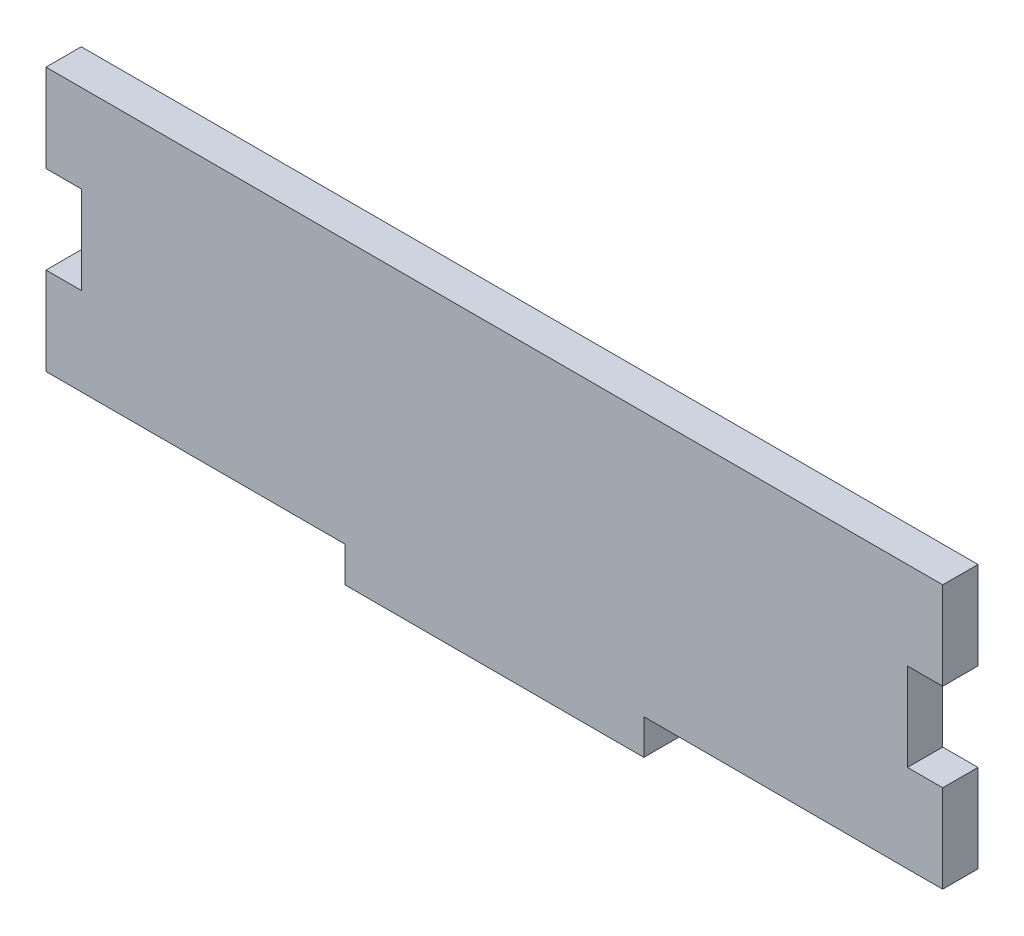
ISO-10303-21;
HEADER;
FILE_DESCRIPTION(('STEP AP214'),'2;1');
FILE_NAME('part.step','',(''),(''),'','','');
FILE_SCHEMA(('AUTOMOTIVE_DESIGN { 1 0 10303 214 1 1 1 1 }'));
ENDSEC;
DATA;
#1=APPLICATION_CONTEXT('core data for automotive mechanical design processes');
#2=APPLICATION_PROTOCOL_DEFINITION('international standard','automotive_design',2000,#1);
#3=PRODUCT_CONTEXT('',#1,'mechanical');
#4=PRODUCT('Part','Part','',(#3));
#5=PRODUCT_RELATED_PRODUCT_CATEGORY('part','',(#4));
#6=PRODUCT_DEFINITION_FORMATION('','',#4);
#7=PRODUCT_DEFINITION_CONTEXT('part definition',#1,'design');
#8=PRODUCT_DEFINITION('design','',#6,#7);
#9=PRODUCT_DEFINITION_SHAPE('','',#8);
#10=(LENGTH_UNIT() NAMED_UNIT(*) SI_UNIT(.MILLI.,.METRE.));
#11=(NAMED_UNIT(*) PLANE_ANGLE_UNIT() SI_UNIT($,.RADIAN.));
#12=(NAMED_UNIT(*) SI_UNIT($,.STERADIAN.) SOLID_ANGLE_UNIT());
#13=UNCERTAINTY_MEASURE_WITH_UNIT(LENGTH_MEASURE(1.E-05),#10,'distance_accuracy_value','');
#14=(GEOMETRIC_REPRESENTATION_CONTEXT(3) GLOBAL_UNCERTAINTY_ASSIGNED_CONTEXT((#13)) GLOBAL_UNIT_ASSIGNED_CONTEXT((#10,
#11,#12)) REPRESENTATION_CONTEXT('',''));
#15=CARTESIAN_POINT('',(0.,0.,0.));
#16=DIRECTION('',(0.,0.,1.));
#17=DIRECTION('',(1.,0.,0.));
#18=AXIS2_PLACEMENT_3D('',#15,#16,#17);
#19=CARTESIAN_POINT('',(-15.3557630292889,18.8528592771537,2.9972));
#20=DIRECTION('',(0.,1.,0.));
#21=DIRECTION('',(0.,0.,1.));
#22=AXIS2_PLACEMENT_3D('',#19,#20,#21);
#23=PLANE('',#22);
#24=DIRECTION('',(1.,0.,0.));
#25=VECTOR('',#24,1.);
#26=CARTESIAN_POINT('',(-15.3557630292889,18.8528592771537,0.));
#27=LINE('',#26,#25);
#28=CARTESIAN_POINT('',(-15.3557630292889,18.8528592771537,0.));
#29=VERTEX_POINT('',#28);
#30=CARTESIAN_POINT('',(-12.3585630292889,18.8528592771537,0.));
#31=VERTEX_POINT('',#30);
#32=EDGE_CURVE('E177',#29,#31,#27,.T.);
#33=ORIENTED_EDGE('',*,*,#32,.T.);
#34=DIRECTION('',(0.,0.,-1.));
#35=VECTOR('',#34,1.);
#36=CARTESIAN_POINT('',(-12.3585630292889,18.8528592771537,2.9972));
#37=LINE('',#36,#35);
#38=CARTESIAN_POINT('',(-12.3585630292889,18.8528592771537,2.9972));
#39=VERTEX_POINT('',#38);
#40=EDGE_CURVE('E11',#39,#31,#37,.T.);
#41=ORIENTED_EDGE('',*,*,#40,.F.);
#42=DIRECTION('',(1.,0.,0.));
#43=VECTOR('',#42,1.);
#44=CARTESIAN_POINT('',(-15.3557630292889,18.8528592771537,2.9972));
#45=LINE('',#44,#43);
#46=CARTESIAN_POINT('',(-15.3557630292889,18.8528592771537,2.9972));
#47=VERTEX_POINT('',#46);
#48=EDGE_CURVE('E207',#47,#39,#45,.T.);
#49=ORIENTED_EDGE('',*,*,#48,.F.);
#50=DIRECTION('',(0.,0.,-1.));
#51=VECTOR('',#50,1.);
#52=CARTESIAN_POINT('',(-15.3557630292889,18.8528592771537,2.9972));
#53=LINE('',#52,#51);
#54=EDGE_CURVE('E173',#47,#29,#53,.T.);
#55=ORIENTED_EDGE('',*,*,#54,.T.);
#56=EDGE_LOOP('',(#33,#41,#49,#55));
#57=FACE_BOUND('',#56,.T.);
#58=ADVANCED_FACE('F33',(#57),#23,.F.);
#59=CARTESIAN_POINT('',(-12.3585630292889,18.8528592771537,2.9972));
#60=DIRECTION('',(1.,0.,0.));
#61=DIRECTION('',(0.,0.,-1.));
#62=AXIS2_PLACEMENT_3D('',#59,#60,#61);
#63=PLANE('',#62);
#64=DIRECTION('',(0.,-1.,0.));
#65=VECTOR('',#64,1.);
#66=CARTESIAN_POINT('',(-12.3585630292889,18.8528592771537,0.));
#67=LINE('',#66,#65);
#68=CARTESIAN_POINT('',(-12.3585630292889,11.3852592771537,0.));
#69=VERTEX_POINT('',#68);
#70=EDGE_CURVE('E180',#31,#69,#67,.T.);
#71=ORIENTED_EDGE('',*,*,#70,.T.);
#72=DIRECTION('',(0.,0.,-1.));
#73=VECTOR('',#72,1.);
#74=CARTESIAN_POINT('',(-12.3585630292889,11.3852592771537,2.9972));
#75=LINE('',#74,#73);
#76=CARTESIAN_POINT('',(-12.3585630292889,11.3852592771537,2.9972));
#77=VERTEX_POINT('',#76);
#78=EDGE_CURVE('E41',#77,#69,#75,.T.);
#79=ORIENTED_EDGE('',*,*,#78,.F.);
#80=DIRECTION('',(0.,-1.,0.));
#81=VECTOR('',#80,1.);
#82=CARTESIAN_POINT('',(-12.3585630292889,18.8528592771537,2.9972));
#83=LINE('',#82,#81);
#84=EDGE_CURVE('E116',#39,#77,#83,.T.);
#85=ORIENTED_EDGE('',*,*,#84,.F.);
#86=ORIENTED_EDGE('',*,*,#40,.T.);
#87=EDGE_LOOP('',(#71,#79,#85,#86));
#88=FACE_BOUND('',#87,.T.);
#89=ADVANCED_FACE('F305',(#88),#63,.F.);
#90=CARTESIAN_POINT('',(-15.3557630292889,11.3852592771537,2.9972));
#91=DIRECTION('',(0.,-1.,0.));
#92=DIRECTION('',(0.,0.,-1.));
#93=AXIS2_PLACEMENT_3D('',#90,#91,#92);
#94=PLANE('',#93);
#95=DIRECTION('',(-1.,0.,0.));
#96=VECTOR('',#95,1.);
#97=CARTESIAN_POINT('',(-15.3557630292889,11.3852592771537,0.));
#98=LINE('',#97,#96);
#99=CARTESIAN_POINT('',(-15.3557630292889,11.3852592771537,0.));
#100=VERTEX_POINT('',#99);
#101=EDGE_CURVE('E182',#69,#100,#98,.T.);
#102=ORIENTED_EDGE('',*,*,#101,.T.);
#103=DIRECTION('',(0.,0.,-1.));
#104=VECTOR('',#103,1.);
#105=CARTESIAN_POINT('',(-15.3557630292889,11.3852592771537,2.9972));
#106=LINE('',#105,#104);
#107=CARTESIAN_POINT('',(-15.3557630292889,11.3852592771537,2.9972));
#108=VERTEX_POINT('',#107);
#109=EDGE_CURVE('E238',#108,#100,#106,.T.);
#110=ORIENTED_EDGE('',*,*,#109,.F.);
#111=DIRECTION('',(-1.,0.,0.));
#112=VECTOR('',#111,1.);
#113=CARTESIAN_POINT('',(-15.3557630292889,11.3852592771537,2.9972));
#114=LINE('',#113,#112);
#115=EDGE_CURVE('E246',#77,#108,#114,.T.);
#116=ORIENTED_EDGE('',*,*,#115,.F.);
#117=ORIENTED_EDGE('',*,*,#78,.T.);
#118=EDGE_LOOP('',(#102,#110,#116,#117));
#119=FACE_BOUND('',#118,.T.);
#120=ADVANCED_FACE('F244',(#119),#94,.F.);
#121=CARTESIAN_POINT('',(-15.3557630292889,3.91765927715367,2.9972));
#122=DIRECTION('',(1.,0.,0.));
#123=DIRECTION('',(0.,1.,0.));
#124=AXIS2_PLACEMENT_3D('',#121,#122,#123);
#125=PLANE('',#124);
#126=DIRECTION('',(0.,-1.,0.));
#127=VECTOR('',#126,1.);
#128=CARTESIAN_POINT('',(-15.3557630292889,3.91765927715367,0.));
#129=LINE('',#128,#127);
#130=CARTESIAN_POINT('',(-15.3557630292889,3.91765927715367,0.));
#131=VERTEX_POINT('',#130);
#132=EDGE_CURVE('E184',#100,#131,#129,.T.);
#133=ORIENTED_EDGE('',*,*,#132,.T.);
#134=DIRECTION('',(0.,0.,-1.));
#135=VECTOR('',#134,1.);
#136=CARTESIAN_POINT('',(-15.3557630292889,3.91765927715367,2.9972));
#137=LINE('',#136,#135);
#138=CARTESIAN_POINT('',(-15.3557630292889,3.91765927715367,2.9972));
#139=VERTEX_POINT('',#138);
#140=EDGE_CURVE('E235',#139,#131,#137,.T.);
#141=ORIENTED_EDGE('',*,*,#140,.F.);
#142=DIRECTION('',(0.,-1.,0.));
#143=VECTOR('',#142,1.);
#144=CARTESIAN_POINT('',(-15.3557630292889,3.91765927715367,2.9972));
#145=LINE('',#144,#143);
#146=EDGE_CURVE('E264',#108,#139,#145,.T.);
#147=ORIENTED_EDGE('',*,*,#146,.F.);
#148=ORIENTED_EDGE('',*,*,#109,.T.);
#149=EDGE_LOOP('',(#133,#141,#147,#148));
#150=FACE_BOUND('',#149,.T.);
#151=ADVANCED_FACE('F255',(#150),#125,.F.);
#152=CARTESIAN_POINT('',(-15.3557630292889,3.91765927715367,2.9972));
#153=DIRECTION('',(0.,1.,0.));
#154=DIRECTION('',(0.,0.,1.));
#155=AXIS2_PLACEMENT_3D('',#152,#153,#154);
#156=PLANE('',#155);
#157=DIRECTION('',(1.,0.,0.));
#158=VECTOR('',#157,1.);
#159=CARTESIAN_POINT('',(-15.3557630292889,3.91765927715367,0.));
#160=LINE('',#159,#158);
#161=CARTESIAN_POINT('',(10.0442369707111,3.91765927715367,0.));
#162=VERTEX_POINT('',#161);
#163=EDGE_CURVE('E186',#131,#162,#160,.T.);
#164=ORIENTED_EDGE('',*,*,#163,.T.);
#165=DIRECTION('',(0.,0.,-1.));
#166=VECTOR('',#165,1.);
#167=CARTESIAN_POINT('',(10.0442369707111,3.91765927715367,2.9972));
#168=LINE('',#167,#166);
#169=CARTESIAN_POINT('',(10.0442369707111,3.91765927715367,2.9972));
#170=VERTEX_POINT('',#169);
#171=EDGE_CURVE('E232',#170,#162,#168,.T.);
#172=ORIENTED_EDGE('',*,*,#171,.F.);
#173=DIRECTION('',(1.,0.,0.));
#174=VECTOR('',#173,1.);
#175=CARTESIAN_POINT('',(-15.3557630292889,3.91765927715367,2.9972));
#176=LINE('',#175,#174);
#177=EDGE_CURVE('E261',#139,#170,#176,.T.);
#178=ORIENTED_EDGE('',*,*,#177,.F.);
#179=ORIENTED_EDGE('',*,*,#140,.T.);
#180=EDGE_LOOP('',(#164,#172,#178,#179));
#181=FACE_BOUND('',#180,.T.);
#182=ADVANCED_FACE('F259',(#181),#156,.F.);
#183=CARTESIAN_POINT('',(10.0442369707111,0.920459277153668,2.9972));
#184=DIRECTION('',(1.,0.,0.));
#185=DIRECTION('',(0.,1.,0.));
#186=AXIS2_PLACEMENT_3D('',#183,#184,#185);
#187=PLANE('',#186);
#188=DIRECTION('',(0.,-1.,0.));
#189=VECTOR('',#188,1.);
#190=CARTESIAN_POINT('',(10.0442369707111,0.920459277153668,0.));
#191=LINE('',#190,#189);
#192=CARTESIAN_POINT('',(10.0442369707111,0.920459277153668,0.));
#193=VERTEX_POINT('',#192);
#194=EDGE_CURVE('E188',#162,#193,#191,.T.);
#195=ORIENTED_EDGE('',*,*,#194,.T.);
#196=DIRECTION('',(0.,0.,-1.));
#197=VECTOR('',#196,1.);
#198=CARTESIAN_POINT('',(10.0442369707111,0.920459277153668,2.9972));
#199=LINE('',#198,#197);
#200=CARTESIAN_POINT('',(10.0442369707111,0.920459277153668,2.9972));
#201=VERTEX_POINT('',#200);
#202=EDGE_CURVE('E229',#201,#193,#199,.T.);
#203=ORIENTED_EDGE('',*,*,#202,.F.);
#204=DIRECTION('',(0.,-1.,0.));
#205=VECTOR('',#204,1.);
#206=CARTESIAN_POINT('',(10.0442369707111,0.920459277153668,2.9972));
#207=LINE('',#206,#205);
#208=EDGE_CURVE('E263',#170,#201,#207,.T.);
#209=ORIENTED_EDGE('',*,*,#208,.F.);
#210=ORIENTED_EDGE('',*,*,#171,.T.);
#211=EDGE_LOOP('',(#195,#203,#209,#210));
#212=FACE_BOUND('',#211,.T.);
#213=ADVANCED_FACE('F318',(#212),#187,.F.);
#214=CARTESIAN_POINT('',(10.0442369707111,0.920459277153668,2.9972));
#215=DIRECTION('',(0.,1.,0.));
#216=DIRECTION('',(0.,0.,1.));
#217=AXIS2_PLACEMENT_3D('',#214,#215,#216);
#218=PLANE('',#217);
#219=DIRECTION('',(1.,0.,0.));
#220=VECTOR('',#219,1.);
#221=CARTESIAN_POINT('',(10.0442369707111,0.920459277153668,0.));
#222=LINE('',#221,#220);
#223=CARTESIAN_POINT('',(35.4442369707111,0.920459277153668,0.));
#224=VERTEX_POINT('',#223);
#225=EDGE_CURVE('E190',#193,#224,#222,.T.);
#226=ORIENTED_EDGE('',*,*,#225,.T.);
#227=DIRECTION('',(0.,0.,-1.));
#228=VECTOR('',#227,1.);
#229=CARTESIAN_POINT('',(35.4442369707111,0.920459277153668,2.9972));
#230=LINE('',#229,#228);
#231=CARTESIAN_POINT('',(35.4442369707111,0.920459277153668,2.9972));
#232=VERTEX_POINT('',#231);
#233=EDGE_CURVE('E226',#232,#224,#230,.T.);
#234=ORIENTED_EDGE('',*,*,#233,.F.);
#235=DIRECTION('',(1.,0.,0.));
#236=VECTOR('',#235,1.);
#237=CARTESIAN_POINT('',(10.0442369707111,0.920459277153668,2.9972));
#238=LINE('',#237,#236);
#239=EDGE_CURVE('E266',#201,#232,#238,.T.);
#240=ORIENTED_EDGE('',*,*,#239,.F.);
#241=ORIENTED_EDGE('',*,*,#202,.T.);
#242=EDGE_LOOP('',(#226,#234,#240,#241));
#243=FACE_BOUND('',#242,.T.);
#244=ADVANCED_FACE('F321',(#243),#218,.F.);
#245=CARTESIAN_POINT('',(35.4442369707111,0.920459277153668,2.9972));
#246=DIRECTION('',(-1.,0.,0.));
#247=DIRECTION('',(0.,0.,1.));
#248=AXIS2_PLACEMENT_3D('',#245,#246,#247);
#249=PLANE('',#248);
#250=DIRECTION('',(0.,1.,0.));
#251=VECTOR('',#250,1.);
#252=CARTESIAN_POINT('',(35.4442369707111,0.920459277153668,0.));
#253=LINE('',#252,#251);
#254=CARTESIAN_POINT('',(35.4442369707111,3.91765927715367,0.));
#255=VERTEX_POINT('',#254);
#256=EDGE_CURVE('E192',#224,#255,#253,.T.);
#257=ORIENTED_EDGE('',*,*,#256,.T.);
#258=DIRECTION('',(0.,0.,-1.));
#259=VECTOR('',#258,1.);
#260=CARTESIAN_POINT('',(35.4442369707111,3.91765927715367,2.9972));
#261=LINE('',#260,#259);
#262=CARTESIAN_POINT('',(35.4442369707111,3.91765927715367,2.9972));
#263=VERTEX_POINT('',#262);
#264=EDGE_CURVE('E223',#263,#255,#261,.T.);
#265=ORIENTED_EDGE('',*,*,#264,.F.);
#266=DIRECTION('',(0.,1.,0.));
#267=VECTOR('',#266,1.);
#268=CARTESIAN_POINT('',(35.4442369707111,0.920459277153668,2.9972));
#269=LINE('',#268,#267);
#270=EDGE_CURVE('E272',#232,#263,#269,.T.);
#271=ORIENTED_EDGE('',*,*,#270,.F.);
#272=ORIENTED_EDGE('',*,*,#233,.T.);
#273=EDGE_LOOP('',(#257,#265,#271,#272));
#274=FACE_BOUND('',#273,.T.);
#275=ADVANCED_FACE('F325',(#274),#249,.F.);
#276=CARTESIAN_POINT('',(60.8442369707111,3.91765927715367,2.9972));
#277=DIRECTION('',(0.,1.,0.));
#278=DIRECTION('',(0.,0.,1.));
#279=AXIS2_PLACEMENT_3D('',#276,#277,#278);
#280=PLANE('',#279);
#281=DIRECTION('',(1.,0.,0.));
#282=VECTOR('',#281,1.);
#283=CARTESIAN_POINT('',(60.8442369707111,3.91765927715367,0.));
#284=LINE('',#283,#282);
#285=CARTESIAN_POINT('',(60.8442369707111,3.91765927715367,0.));
#286=VERTEX_POINT('',#285);
#287=EDGE_CURVE('E194',#255,#286,#284,.T.);
#288=ORIENTED_EDGE('',*,*,#287,.T.);
#289=DIRECTION('',(0.,0.,-1.));
#290=VECTOR('',#289,1.);
#291=CARTESIAN_POINT('',(60.8442369707111,3.91765927715367,2.9972));
#292=LINE('',#291,#290);
#293=CARTESIAN_POINT('',(60.8442369707111,3.91765927715367,2.9972));
#294=VERTEX_POINT('',#293);
#295=EDGE_CURVE('E220',#294,#286,#292,.T.);
#296=ORIENTED_EDGE('',*,*,#295,.F.);
#297=DIRECTION('',(1.,0.,0.));
#298=VECTOR('',#297,1.);
#299=CARTESIAN_POINT('',(60.8442369707111,3.91765927715367,2.9972));
#300=LINE('',#299,#298);
#301=EDGE_CURVE('E274',#263,#294,#300,.T.);
#302=ORIENTED_EDGE('',*,*,#301,.F.);
#303=ORIENTED_EDGE('',*,*,#264,.T.);
#304=EDGE_LOOP('',(#288,#296,#302,#303));
#305=FACE_BOUND('',#304,.T.);
#306=ADVANCED_FACE('F329',(#305),#280,.F.);
#307=CARTESIAN_POINT('',(60.8442369707111,3.91765927715367,2.9972));
#308=DIRECTION('',(-1.,0.,0.));
#309=DIRECTION('',(0.,-1.,0.));
#310=AXIS2_PLACEMENT_3D('',#307,#308,#309);
#311=PLANE('',#310);
#312=DIRECTION('',(0.,1.,0.));
#313=VECTOR('',#312,1.);
#314=CARTESIAN_POINT('',(60.8442369707111,3.91765927715367,0.));
#315=LINE('',#314,#313);
#316=CARTESIAN_POINT('',(60.8442369707111,11.3852592771537,0.));
#317=VERTEX_POINT('',#316);
#318=EDGE_CURVE('E196',#286,#317,#315,.T.);
#319=ORIENTED_EDGE('',*,*,#318,.T.);
#320=DIRECTION('',(0.,0.,-1.));
#321=VECTOR('',#320,1.);
#322=CARTESIAN_POINT('',(60.8442369707111,11.3852592771537,2.9972));
#323=LINE('',#322,#321);
#324=CARTESIAN_POINT('',(60.8442369707111,11.3852592771537,2.9972));
#325=VERTEX_POINT('',#324);
#326=EDGE_CURVE('E217',#325,#317,#323,.T.);
#327=ORIENTED_EDGE('',*,*,#326,.F.);
#328=DIRECTION('',(0.,1.,0.));
#329=VECTOR('',#328,1.);
#330=CARTESIAN_POINT('',(60.8442369707111,3.91765927715367,2.9972));
#331=LINE('',#330,#329);
#332=EDGE_CURVE('E276',#294,#325,#331,.T.);
#333=ORIENTED_EDGE('',*,*,#332,.F.);
#334=ORIENTED_EDGE('',*,*,#295,.T.);
#335=EDGE_LOOP('',(#319,#327,#333,#334));
#336=FACE_BOUND('',#335,.T.);
#337=ADVANCED_FACE('F333',(#336),#311,.F.);
#338=CARTESIAN_POINT('',(60.8442369707111,11.3852592771537,2.9972));
#339=DIRECTION('',(0.,-1.,0.));
#340=DIRECTION('',(0.,0.,-1.));
#341=AXIS2_PLACEMENT_3D('',#338,#339,#340);
#342=PLANE('',#341);
#343=DIRECTION('',(-1.,0.,0.));
#344=VECTOR('',#343,1.);
#345=CARTESIAN_POINT('',(60.8442369707111,11.3852592771537,0.));
#346=LINE('',#345,#344);
#347=CARTESIAN_POINT('',(57.8470369707111,11.3852592771537,0.));
#348=VERTEX_POINT('',#347);
#349=EDGE_CURVE('E198',#317,#348,#346,.T.);
#350=ORIENTED_EDGE('',*,*,#349,.T.);
#351=DIRECTION('',(0.,0.,-1.));
#352=VECTOR('',#351,1.);
#353=CARTESIAN_POINT('',(57.8470369707111,11.3852592771537,2.9972));
#354=LINE('',#353,#352);
#355=CARTESIAN_POINT('',(57.8470369707111,11.3852592771537,2.9972));
#356=VERTEX_POINT('',#355);
#357=EDGE_CURVE('E214',#356,#348,#354,.T.);
#358=ORIENTED_EDGE('',*,*,#357,.F.);
#359=DIRECTION('',(-1.,0.,0.));
#360=VECTOR('',#359,1.);
#361=CARTESIAN_POINT('',(60.8442369707111,11.3852592771537,2.9972));
#362=LINE('',#361,#360);
#363=EDGE_CURVE('E278',#325,#356,#362,.T.);
#364=ORIENTED_EDGE('',*,*,#363,.F.);
#365=ORIENTED_EDGE('',*,*,#326,.T.);
#366=EDGE_LOOP('',(#350,#358,#364,#365));
#367=FACE_BOUND('',#366,.T.);
#368=ADVANCED_FACE('F337',(#367),#342,.F.);
#369=CARTESIAN_POINT('',(57.8470369707111,18.8528592771537,2.9972));
#370=DIRECTION('',(-1.,0.,0.));
#371=DIRECTION('',(0.,0.,1.));
#372=AXIS2_PLACEMENT_3D('',#369,#370,#371);
#373=PLANE('',#372);
#374=DIRECTION('',(0.,1.,0.));
#375=VECTOR('',#374,1.);
#376=CARTESIAN_POINT('',(57.8470369707111,18.8528592771537,0.));
#377=LINE('',#376,#375);
#378=CARTESIAN_POINT('',(57.8470369707111,18.8528592771537,0.));
#379=VERTEX_POINT('',#378);
#380=EDGE_CURVE('E200',#348,#379,#377,.T.);
#381=ORIENTED_EDGE('',*,*,#380,.T.);
#382=DIRECTION('',(0.,0.,-1.));
#383=VECTOR('',#382,1.);
#384=CARTESIAN_POINT('',(57.8470369707111,18.8528592771537,2.9972));
#385=LINE('',#384,#383);
#386=CARTESIAN_POINT('',(57.8470369707111,18.8528592771537,2.9972));
#387=VERTEX_POINT('',#386);
#388=EDGE_CURVE('E211',#387,#379,#385,.T.);
#389=ORIENTED_EDGE('',*,*,#388,.F.);
#390=DIRECTION('',(0.,1.,0.));
#391=VECTOR('',#390,1.);
#392=CARTESIAN_POINT('',(57.8470369707111,18.8528592771537,2.9972));
#393=LINE('',#392,#391);
#394=EDGE_CURVE('E280',#356,#387,#393,.T.);
#395=ORIENTED_EDGE('',*,*,#394,.F.);
#396=ORIENTED_EDGE('',*,*,#357,.T.);
#397=EDGE_LOOP('',(#381,#389,#395,#396));
#398=FACE_BOUND('',#397,.T.);
#399=ADVANCED_FACE('F286',(#398),#373,.F.);
#400=CARTESIAN_POINT('',(60.8442369707111,18.8528592771537,2.9972));
#401=DIRECTION('',(0.,1.,0.));
#402=DIRECTION('',(0.,0.,1.));
#403=AXIS2_PLACEMENT_3D('',#400,#401,#402);
#404=PLANE('',#403);
#405=DIRECTION('',(1.,0.,0.));
#406=VECTOR('',#405,1.);
#407=CARTESIAN_POINT('',(60.8442369707111,18.8528592771537,0.));
#408=LINE('',#407,#406);
#409=CARTESIAN_POINT('',(60.8442369707111,18.8528592771537,0.));
#410=VERTEX_POINT('',#409);
#411=EDGE_CURVE('E202',#379,#410,#408,.T.);
#412=ORIENTED_EDGE('',*,*,#411,.T.);
#413=DIRECTION('',(0.,0.,-1.));
#414=VECTOR('',#413,1.);
#415=CARTESIAN_POINT('',(60.8442369707111,18.8528592771537,2.9972));
#416=LINE('',#415,#414);
#417=CARTESIAN_POINT('',(60.8442369707111,18.8528592771537,2.9972));
#418=VERTEX_POINT('',#417);
#419=EDGE_CURVE('E168',#418,#410,#416,.T.);
#420=ORIENTED_EDGE('',*,*,#419,.F.);
#421=DIRECTION('',(1.,0.,0.));
#422=VECTOR('',#421,1.);
#423=CARTESIAN_POINT('',(60.8442369707111,18.8528592771537,2.9972));
#424=LINE('',#423,#422);
#425=EDGE_CURVE('E159',#387,#418,#424,.T.);
#426=ORIENTED_EDGE('',*,*,#425,.F.);
#427=ORIENTED_EDGE('',*,*,#388,.T.);
#428=EDGE_LOOP('',(#412,#420,#426,#427));
#429=FACE_BOUND('',#428,.T.);
#430=ADVANCED_FACE('F290',(#429),#404,.F.);
#431=CARTESIAN_POINT('',(60.8442369707111,18.8528592771537,2.9972));
#432=DIRECTION('',(-1.,0.,0.));
#433=DIRECTION('',(0.,0.,1.));
#434=AXIS2_PLACEMENT_3D('',#431,#432,#433);
#435=PLANE('',#434);
#436=DIRECTION('',(0.,1.,0.));
#437=VECTOR('',#436,1.);
#438=CARTESIAN_POINT('',(60.8442369707111,18.8528592771537,0.));
#439=LINE('',#438,#437);
#440=CARTESIAN_POINT('',(60.8442369707111,26.3204592771537,0.));
#441=VERTEX_POINT('',#440);
#442=EDGE_CURVE('E167',#410,#441,#439,.T.);
#443=ORIENTED_EDGE('',*,*,#442,.T.);
#444=DIRECTION('',(0.,0.,-1.));
#445=VECTOR('',#444,1.);
#446=CARTESIAN_POINT('',(60.8442369707111,26.3204592771537,2.9972));
#447=LINE('',#446,#445);
#448=CARTESIAN_POINT('',(60.8442369707111,26.3204592771537,2.9972));
#449=VERTEX_POINT('',#448);
#450=EDGE_CURVE('E164',#449,#441,#447,.T.);
#451=ORIENTED_EDGE('',*,*,#450,.F.);
#452=DIRECTION('',(0.,1.,0.));
#453=VECTOR('',#452,1.);
#454=CARTESIAN_POINT('',(60.8442369707111,18.8528592771537,2.9972));
#455=LINE('',#454,#453);
#456=EDGE_CURVE('E153',#418,#449,#455,.T.);
#457=ORIENTED_EDGE('',*,*,#456,.F.);
#458=ORIENTED_EDGE('',*,*,#419,.T.);
#459=EDGE_LOOP('',(#443,#451,#457,#458));
#460=FACE_BOUND('',#459,.T.);
#461=ADVANCED_FACE('F165',(#460),#435,.F.);
#462=CARTESIAN_POINT('',(-15.3557630292889,26.3204592771537,2.9972));
#463=DIRECTION('',(0.,-1.,0.));
#464=DIRECTION('',(0.,0.,-1.));
#465=AXIS2_PLACEMENT_3D('',#462,#463,#464);
#466=PLANE('',#465);
#467=DIRECTION('',(-1.,0.,0.));
#468=VECTOR('',#467,1.);
#469=CARTESIAN_POINT('',(-15.3557630292889,26.3204592771537,0.));
#470=LINE('',#469,#468);
#471=CARTESIAN_POINT('',(-15.3557630292889,26.3204592771537,0.));
#472=VERTEX_POINT('',#471);
#473=EDGE_CURVE('E102',#441,#472,#470,.T.);
#474=ORIENTED_EDGE('',*,*,#473,.T.);
#475=DIRECTION('',(0.,0.,-1.));
#476=VECTOR('',#475,1.);
#477=CARTESIAN_POINT('',(-15.3557630292889,26.3204592771537,2.9972));
#478=LINE('',#477,#476);
#479=CARTESIAN_POINT('',(-15.3557630292889,26.3204592771537,2.9972));
#480=VERTEX_POINT('',#479);
#481=EDGE_CURVE('E169',#480,#472,#478,.T.);
#482=ORIENTED_EDGE('',*,*,#481,.F.);
#483=DIRECTION('',(-1.,0.,0.));
#484=VECTOR('',#483,1.);
#485=CARTESIAN_POINT('',(-15.3557630292889,26.3204592771537,2.9972));
#486=LINE('',#485,#484);
#487=EDGE_CURVE('E157',#449,#480,#486,.T.);
#488=ORIENTED_EDGE('',*,*,#487,.F.);
#489=ORIENTED_EDGE('',*,*,#450,.T.);
#490=EDGE_LOOP('',(#474,#482,#488,#489));
#491=FACE_BOUND('',#490,.T.);
#492=ADVANCED_FACE('F171',(#491),#466,.F.);
#493=CARTESIAN_POINT('',(-15.3557630292889,18.8528592771537,2.9972));
#494=DIRECTION('',(1.,0.,0.));
#495=DIRECTION('',(0.,0.,-1.));
#496=AXIS2_PLACEMENT_3D('',#493,#494,#495);
#497=PLANE('',#496);
#498=DIRECTION('',(0.,-1.,0.));
#499=VECTOR('',#498,1.);
#500=CARTESIAN_POINT('',(-15.3557630292889,18.8528592771537,0.));
#501=LINE('',#500,#499);
#502=EDGE_CURVE('E108',#472,#29,#501,.T.);
#503=ORIENTED_EDGE('',*,*,#502,.T.);
#504=ORIENTED_EDGE('',*,*,#54,.F.);
#505=DIRECTION('',(0.,-1.,0.));
#506=VECTOR('',#505,1.);
#507=CARTESIAN_POINT('',(-15.3557630292889,18.8528592771537,2.9972));
#508=LINE('',#507,#506);
#509=EDGE_CURVE('E49',#480,#47,#508,.T.);
#510=ORIENTED_EDGE('',*,*,#509,.F.);
#511=ORIENTED_EDGE('',*,*,#481,.T.);
#512=EDGE_LOOP('',(#503,#504,#510,#511));
#513=FACE_BOUND('',#512,.T.);
#514=ADVANCED_FACE('F294',(#513),#497,.F.);
#515=CARTESIAN_POINT('',(-12.3585630292889,18.8528592771537,2.9972));
#516=DIRECTION('',(0.,0.,-1.));
#517=DIRECTION('',(-1.,0.,0.));
#518=AXIS2_PLACEMENT_3D('',#515,#516,#517);
#519=PLANE('',#518);
#520=ORIENTED_EDGE('',*,*,#48,.T.);
#521=ORIENTED_EDGE('',*,*,#84,.T.);
#522=ORIENTED_EDGE('',*,*,#115,.T.);
#523=ORIENTED_EDGE('',*,*,#146,.T.);
#524=ORIENTED_EDGE('',*,*,#177,.T.);
#525=ORIENTED_EDGE('',*,*,#208,.T.);
#526=ORIENTED_EDGE('',*,*,#239,.T.);
#527=ORIENTED_EDGE('',*,*,#270,.T.);
#528=ORIENTED_EDGE('',*,*,#301,.T.);
#529=ORIENTED_EDGE('',*,*,#332,.T.);
#530=ORIENTED_EDGE('',*,*,#363,.T.);
#531=ORIENTED_EDGE('',*,*,#394,.T.);
#532=ORIENTED_EDGE('',*,*,#425,.T.);
#533=ORIENTED_EDGE('',*,*,#456,.T.);
#534=ORIENTED_EDGE('',*,*,#487,.T.);
#535=ORIENTED_EDGE('',*,*,#509,.T.);
#536=EDGE_LOOP('',(#520,#521,#522,#523,#524,#525,#526,#527,#528,#529,#530,#531,#532,#533,#534,#535));
#537=FACE_BOUND('',#536,.T.);
#538=ADVANCED_FACE('F155',(#537),#519,.F.);
#539=CARTESIAN_POINT('',(-12.3585630292889,18.8528592771537,0.));
#540=DIRECTION('',(0.,0.,-1.));
#541=DIRECTION('',(-1.,0.,0.));
#542=AXIS2_PLACEMENT_3D('',#539,#540,#541);
#543=PLANE('',#542);
#544=ORIENTED_EDGE('',*,*,#32,.F.);
#545=ORIENTED_EDGE('',*,*,#502,.F.);
#546=ORIENTED_EDGE('',*,*,#473,.F.);
#547=ORIENTED_EDGE('',*,*,#442,.F.);
#548=ORIENTED_EDGE('',*,*,#411,.F.);
#549=ORIENTED_EDGE('',*,*,#380,.F.);
#550=ORIENTED_EDGE('',*,*,#349,.F.);
#551=ORIENTED_EDGE('',*,*,#318,.F.);
#552=ORIENTED_EDGE('',*,*,#287,.F.);
#553=ORIENTED_EDGE('',*,*,#256,.F.);
#554=ORIENTED_EDGE('',*,*,#225,.F.);
#555=ORIENTED_EDGE('',*,*,#194,.F.);
#556=ORIENTED_EDGE('',*,*,#163,.F.);
#557=ORIENTED_EDGE('',*,*,#132,.F.);
#558=ORIENTED_EDGE('',*,*,#101,.F.);
#559=ORIENTED_EDGE('',*,*,#70,.F.);
#560=EDGE_LOOP('',(#544,#545,#546,#547,#548,#549,#550,#551,#552,#553,#554,#555,#556,#557,#558,#559));
#561=FACE_BOUND('',#560,.T.);
#562=ADVANCED_FACE('F250',(#561),#543,.T.);
#563=CLOSED_SHELL('',(#58,#89,#120,#151,#182,#213,#244,#275,#306,#337,#368,#399,#430,#461,#492,
#514,#538,#562));
#564=MANIFOLD_SOLID_BREP('B2',#563);
#565=ADVANCED_BREP_SHAPE_REPRESENTATION('',(#18,#564),#14);
#566=SHAPE_DEFINITION_REPRESENTATION(#9,#565);
ENDSEC;
END-ISO-10303-21;
